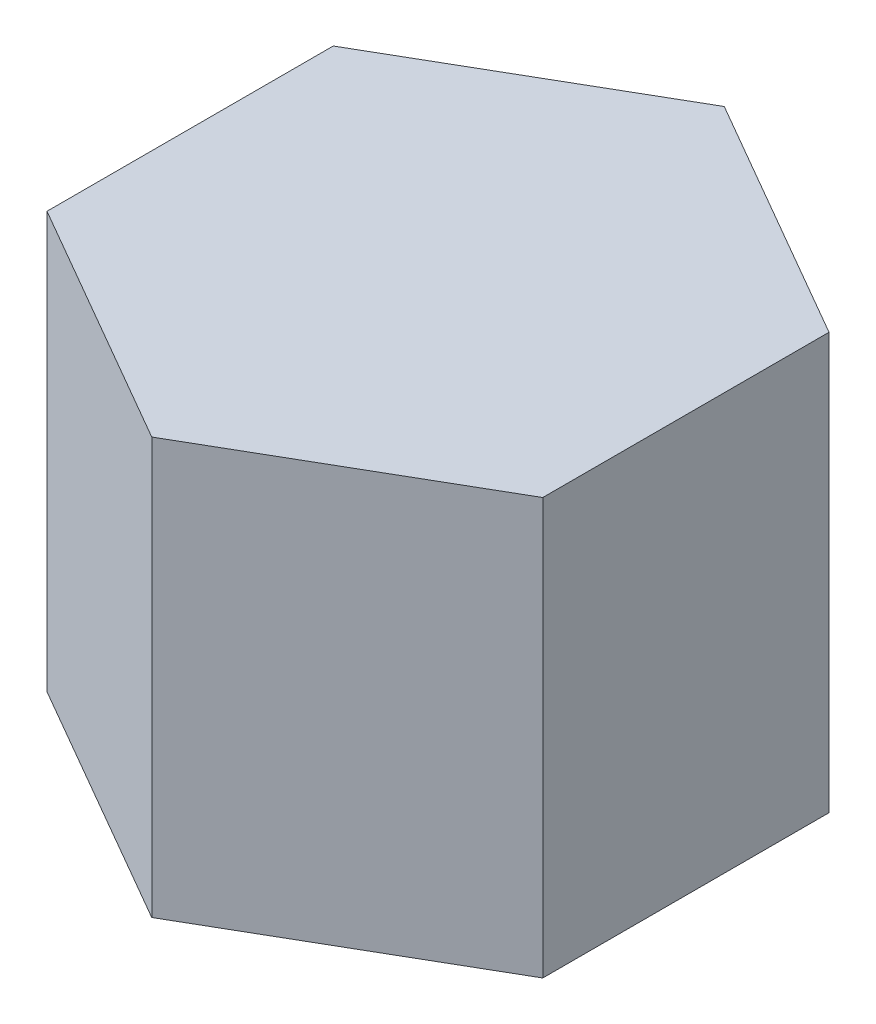
ISO-10303-21;
HEADER;
FILE_DESCRIPTION(('STEP AP214'),'2;1');
FILE_NAME('part.step','',(''),(''),'','','');
FILE_SCHEMA(('AUTOMOTIVE_DESIGN { 1 0 10303 214 1 1 1 1 }'));
ENDSEC;
DATA;
#1=APPLICATION_CONTEXT('core data for automotive mechanical design processes');
#2=APPLICATION_PROTOCOL_DEFINITION('international standard','automotive_design',2000,#1);
#3=PRODUCT_CONTEXT('',#1,'mechanical');
#4=PRODUCT('Part','Part','',(#3));
#5=PRODUCT_RELATED_PRODUCT_CATEGORY('part','',(#4));
#6=PRODUCT_DEFINITION_FORMATION('','',#4);
#7=PRODUCT_DEFINITION_CONTEXT('part definition',#1,'design');
#8=PRODUCT_DEFINITION('design','',#6,#7);
#9=PRODUCT_DEFINITION_SHAPE('','',#8);
#10=(LENGTH_UNIT() NAMED_UNIT(*) SI_UNIT(.MILLI.,.METRE.));
#11=(NAMED_UNIT(*) PLANE_ANGLE_UNIT() SI_UNIT($,.RADIAN.));
#12=(NAMED_UNIT(*) SI_UNIT($,.STERADIAN.) SOLID_ANGLE_UNIT());
#13=UNCERTAINTY_MEASURE_WITH_UNIT(LENGTH_MEASURE(1.E-05),#10,'distance_accuracy_value','');
#14=(GEOMETRIC_REPRESENTATION_CONTEXT(3) GLOBAL_UNCERTAINTY_ASSIGNED_CONTEXT((#13)) GLOBAL_UNIT_ASSIGNED_CONTEXT((#10,
#11,#12)) REPRESENTATION_CONTEXT('',''));
#15=CARTESIAN_POINT('',(0.,0.,0.));
#16=DIRECTION('',(0.,0.,1.));
#17=DIRECTION('',(1.,0.,0.));
#18=AXIS2_PLACEMENT_3D('',#15,#16,#17);
#19=CARTESIAN_POINT('',(209.839551417382,-147.556598747966,290.81594581671));
#20=DIRECTION('',(-0.499999999999943,0.,-0.866025403784471));
#21=DIRECTION('',(-0.866025403784471,0.,0.499999999999943));
#22=AXIS2_PLACEMENT_3D('',#19,#20,#21);
#23=PLANE('',#22);
#24=CARTESIAN_POINT('',(210.142660308706,-147.047793579175,290.64094581671));
#25=DIRECTION('',(-0.866025403784471,0.,0.499999999999943));
#26=VECTOR('',#25,1.);
#27=LINE('',#24,#26);
#28=CARTESIAN_POINT('',(210.142660308706,-147.047793579175,290.64094581671));
#29=VERTEX_POINT('',#28);
#30=CARTESIAN_POINT('',(209.839551417382,-147.047793579175,290.81594581671));
#31=VERTEX_POINT('',#30);
#32=EDGE_CURVE('E170',#29,#31,#27,.T.);
#33=ORIENTED_EDGE('',*,*,#32,.T.);
#34=CARTESIAN_POINT('',(209.839551417382,-147.556598747966,290.81594581671));
#35=DIRECTION('',(0.,1.,0.));
#36=VECTOR('',#35,1.);
#37=LINE('',#34,#36);
#38=CARTESIAN_POINT('',(209.839551417382,-147.556598747966,290.81594581671));
#39=VERTEX_POINT('',#38);
#40=EDGE_CURVE('E35',#39,#31,#37,.T.);
#41=ORIENTED_EDGE('',*,*,#40,.F.);
#42=CARTESIAN_POINT('',(210.142660308706,-147.556598747966,290.64094581671));
#43=DIRECTION('',(-0.866025403784471,0.,0.499999999999943));
#44=VECTOR('',#43,1.);
#45=LINE('',#42,#44);
#46=CARTESIAN_POINT('',(210.142660308706,-147.556598747966,290.64094581671));
#47=VERTEX_POINT('',#46);
#48=EDGE_CURVE('E159',#47,#39,#45,.T.);
#49=ORIENTED_EDGE('',*,*,#48,.F.);
#50=CARTESIAN_POINT('',(210.142660308706,-147.556598747966,290.64094581671));
#51=DIRECTION('',(0.,1.,0.));
#52=VECTOR('',#51,1.);
#53=LINE('',#50,#52);
#54=EDGE_CURVE('E10',#47,#29,#53,.T.);
#55=ORIENTED_EDGE('',*,*,#54,.T.);
#56=EDGE_LOOP('',(#33,#41,#49,#55));
#57=FACE_BOUND('',#56,.T.);
#58=ADVANCED_FACE('F16',(#57),#23,.F.);
#59=CARTESIAN_POINT('',(210.142660308706,-147.556598747966,291.594471220494));
#60=DIRECTION('',(-1.,0.,0.));
#61=DIRECTION('',(0.,-1.,0.));
#62=AXIS2_PLACEMENT_3D('',#59,#60,#61);
#63=PLANE('',#62);
#64=CARTESIAN_POINT('',(210.142660308706,-147.047793579175,290.29094581671));
#65=DIRECTION('',(0.,0.,1.));
#66=VECTOR('',#65,1.);
#67=LINE('',#64,#66);
#68=CARTESIAN_POINT('',(210.142660308706,-147.047793579175,290.29094581671));
#69=VERTEX_POINT('',#68);
#70=EDGE_CURVE('E167',#69,#29,#67,.T.);
#71=ORIENTED_EDGE('',*,*,#70,.T.);
#72=ORIENTED_EDGE('',*,*,#54,.F.);
#73=CARTESIAN_POINT('',(210.142660308706,-147.556598747966,290.29094581671));
#74=DIRECTION('',(0.,0.,1.));
#75=VECTOR('',#74,1.);
#76=LINE('',#73,#75);
#77=CARTESIAN_POINT('',(210.142660308706,-147.556598747966,290.29094581671));
#78=VERTEX_POINT('',#77);
#79=EDGE_CURVE('E156',#78,#47,#76,.T.);
#80=ORIENTED_EDGE('',*,*,#79,.F.);
#81=CARTESIAN_POINT('',(210.142660308706,-147.556598747966,290.29094581671));
#82=DIRECTION('',(0.,1.,0.));
#83=VECTOR('',#82,1.);
#84=LINE('',#81,#83);
#85=EDGE_CURVE('E27',#78,#69,#84,.T.);
#86=ORIENTED_EDGE('',*,*,#85,.T.);
#87=EDGE_LOOP('',(#71,#72,#80,#86));
#88=FACE_BOUND('',#87,.T.);
#89=ADVANCED_FACE('F189',(#88),#63,.F.);
#90=CARTESIAN_POINT('',(210.142660308706,-147.556598747966,290.29094581671));
#91=DIRECTION('',(-0.499999999999943,0.,0.866025403784471));
#92=DIRECTION('',(0.866025403784471,0.,0.499999999999943));
#93=AXIS2_PLACEMENT_3D('',#90,#91,#92);
#94=PLANE('',#93);
#95=CARTESIAN_POINT('',(209.839551417382,-147.047793579175,290.11594581671));
#96=DIRECTION('',(0.866025403784471,0.,0.499999999999943));
#97=VECTOR('',#96,1.);
#98=LINE('',#95,#97);
#99=CARTESIAN_POINT('',(209.839551417382,-147.047793579175,290.11594581671));
#100=VERTEX_POINT('',#99);
#101=EDGE_CURVE('E163',#100,#69,#98,.T.);
#102=ORIENTED_EDGE('',*,*,#101,.T.);
#103=ORIENTED_EDGE('',*,*,#85,.F.);
#104=CARTESIAN_POINT('',(209.839551417382,-147.556598747966,290.11594581671));
#105=DIRECTION('',(0.866025403784471,0.,0.499999999999943));
#106=VECTOR('',#105,1.);
#107=LINE('',#104,#106);
#108=CARTESIAN_POINT('',(209.839551417382,-147.556598747966,290.11594581671));
#109=VERTEX_POINT('',#108);
#110=EDGE_CURVE('E106',#109,#78,#107,.T.);
#111=ORIENTED_EDGE('',*,*,#110,.F.);
#112=CARTESIAN_POINT('',(209.839551417382,-147.556598747966,290.11594581671));
#113=DIRECTION('',(0.,1.,0.));
#114=VECTOR('',#113,1.);
#115=LINE('',#112,#114);
#116=EDGE_CURVE('E94',#109,#100,#115,.T.);
#117=ORIENTED_EDGE('',*,*,#116,.T.);
#118=EDGE_LOOP('',(#102,#103,#111,#117));
#119=FACE_BOUND('',#118,.T.);
#120=ADVANCED_FACE('F198',(#119),#94,.F.);
#121=CARTESIAN_POINT('',(209.839551417382,-147.556598747966,290.11594581671));
#122=DIRECTION('',(0.499999999999978,0.,0.866025403784452));
#123=DIRECTION('',(0.866025403784452,0.,-0.499999999999978));
#124=AXIS2_PLACEMENT_3D('',#121,#122,#123);
#125=PLANE('',#124);
#126=CARTESIAN_POINT('',(209.536442526057,-147.047793579175,290.29094581671));
#127=DIRECTION('',(0.866025403784452,0.,-0.499999999999978));
#128=VECTOR('',#127,1.);
#129=LINE('',#126,#128);
#130=CARTESIAN_POINT('',(209.536442526057,-147.047793579175,290.29094581671));
#131=VERTEX_POINT('',#130);
#132=EDGE_CURVE('E162',#131,#100,#129,.T.);
#133=ORIENTED_EDGE('',*,*,#132,.T.);
#134=ORIENTED_EDGE('',*,*,#116,.F.);
#135=CARTESIAN_POINT('',(209.536442526057,-147.556598747966,290.29094581671));
#136=DIRECTION('',(0.866025403784452,0.,-0.499999999999978));
#137=VECTOR('',#136,1.);
#138=LINE('',#135,#137);
#139=CARTESIAN_POINT('',(209.536442526057,-147.556598747966,290.29094581671));
#140=VERTEX_POINT('',#139);
#141=EDGE_CURVE('E98',#140,#109,#138,.T.);
#142=ORIENTED_EDGE('',*,*,#141,.F.);
#143=CARTESIAN_POINT('',(209.536442526057,-147.556598747966,290.29094581671));
#144=DIRECTION('',(0.,1.,0.));
#145=VECTOR('',#144,1.);
#146=LINE('',#143,#145);
#147=EDGE_CURVE('E79',#140,#131,#146,.T.);
#148=ORIENTED_EDGE('',*,*,#147,.T.);
#149=EDGE_LOOP('',(#133,#134,#142,#148));
#150=FACE_BOUND('',#149,.T.);
#151=ADVANCED_FACE('F100',(#150),#125,.F.);
#152=CARTESIAN_POINT('',(209.536442526057,-147.556598747966,291.594471220494));
#153=DIRECTION('',(1.,0.,0.));
#154=DIRECTION('',(0.,1.,0.));
#155=AXIS2_PLACEMENT_3D('',#152,#153,#154);
#156=PLANE('',#155);
#157=CARTESIAN_POINT('',(209.536442526057,-147.047793579175,290.64094581671));
#158=DIRECTION('',(0.,0.,-1.));
#159=VECTOR('',#158,1.);
#160=LINE('',#157,#159);
#161=CARTESIAN_POINT('',(209.536442526057,-147.047793579175,290.64094581671));
#162=VERTEX_POINT('',#161);
#163=EDGE_CURVE('E88',#162,#131,#160,.T.);
#164=ORIENTED_EDGE('',*,*,#163,.T.);
#165=ORIENTED_EDGE('',*,*,#147,.F.);
#166=CARTESIAN_POINT('',(209.536442526057,-147.556598747966,290.64094581671));
#167=DIRECTION('',(0.,0.,-1.));
#168=VECTOR('',#167,1.);
#169=LINE('',#166,#168);
#170=CARTESIAN_POINT('',(209.536442526057,-147.556598747966,290.64094581671));
#171=VERTEX_POINT('',#170);
#172=EDGE_CURVE('E84',#171,#140,#169,.T.);
#173=ORIENTED_EDGE('',*,*,#172,.F.);
#174=CARTESIAN_POINT('',(209.536442526057,-147.556598747966,290.64094581671));
#175=DIRECTION('',(0.,1.,0.));
#176=VECTOR('',#175,1.);
#177=LINE('',#174,#176);
#178=EDGE_CURVE('E58',#171,#162,#177,.T.);
#179=ORIENTED_EDGE('',*,*,#178,.T.);
#180=EDGE_LOOP('',(#164,#165,#173,#179));
#181=FACE_BOUND('',#180,.T.);
#182=ADVANCED_FACE('F82',(#181),#156,.F.);
#183=CARTESIAN_POINT('',(209.536442526057,-147.556598747966,290.64094581671));
#184=DIRECTION('',(0.499999999999943,0.,-0.866025403784471));
#185=DIRECTION('',(-0.866025403784471,0.,-0.499999999999943));
#186=AXIS2_PLACEMENT_3D('',#183,#184,#185);
#187=PLANE('',#186);
#188=CARTESIAN_POINT('',(209.839551417382,-147.047793579175,290.81594581671));
#189=DIRECTION('',(-0.866025403784471,0.,-0.499999999999943));
#190=VECTOR('',#189,1.);
#191=LINE('',#188,#190);
#192=EDGE_CURVE('E160',#31,#162,#191,.T.);
#193=ORIENTED_EDGE('',*,*,#192,.T.);
#194=ORIENTED_EDGE('',*,*,#178,.F.);
#195=CARTESIAN_POINT('',(209.839551417382,-147.556598747966,290.81594581671));
#196=DIRECTION('',(-0.866025403784471,0.,-0.499999999999943));
#197=VECTOR('',#196,1.);
#198=LINE('',#195,#197);
#199=EDGE_CURVE('E112',#39,#171,#198,.T.);
#200=ORIENTED_EDGE('',*,*,#199,.F.);
#201=ORIENTED_EDGE('',*,*,#40,.T.);
#202=EDGE_LOOP('',(#193,#194,#200,#201));
#203=FACE_BOUND('',#202,.T.);
#204=ADVANCED_FACE('F131',(#203),#187,.F.);
#205=CARTESIAN_POINT('',(206.491105863044,-147.556598747966,291.594471220494));
#206=DIRECTION('',(0.,1.,0.));
#207=DIRECTION('',(-1.,0.,0.));
#208=AXIS2_PLACEMENT_3D('',#205,#206,#207);
#209=PLANE('',#208);
#210=ORIENTED_EDGE('',*,*,#48,.T.);
#211=ORIENTED_EDGE('',*,*,#199,.T.);
#212=ORIENTED_EDGE('',*,*,#172,.T.);
#213=ORIENTED_EDGE('',*,*,#141,.T.);
#214=ORIENTED_EDGE('',*,*,#110,.T.);
#215=ORIENTED_EDGE('',*,*,#79,.T.);
#216=EDGE_LOOP('',(#210,#211,#212,#213,#214,#215));
#217=FACE_BOUND('',#216,.T.);
#218=ADVANCED_FACE('F111',(#217),#209,.F.);
#219=CARTESIAN_POINT('',(206.491105863044,-147.047793579175,291.594471220494));
#220=DIRECTION('',(0.,1.,0.));
#221=DIRECTION('',(-1.,0.,0.));
#222=AXIS2_PLACEMENT_3D('',#219,#220,#221);
#223=PLANE('',#222);
#224=ORIENTED_EDGE('',*,*,#32,.F.);
#225=ORIENTED_EDGE('',*,*,#70,.F.);
#226=ORIENTED_EDGE('',*,*,#101,.F.);
#227=ORIENTED_EDGE('',*,*,#132,.F.);
#228=ORIENTED_EDGE('',*,*,#163,.F.);
#229=ORIENTED_EDGE('',*,*,#192,.F.);
#230=EDGE_LOOP('',(#224,#225,#226,#227,#228,#229));
#231=FACE_BOUND('',#230,.T.);
#232=ADVANCED_FACE('F130',(#231),#223,.T.);
#233=CLOSED_SHELL('',(#58,#89,#120,#151,#182,#204,#218,#232));
#234=MANIFOLD_SOLID_BREP('B1',#233);
#235=ADVANCED_BREP_SHAPE_REPRESENTATION('',(#18,#234),#14);
#236=SHAPE_DEFINITION_REPRESENTATION(#9,#235);
ENDSEC;
END-ISO-10303-21;
